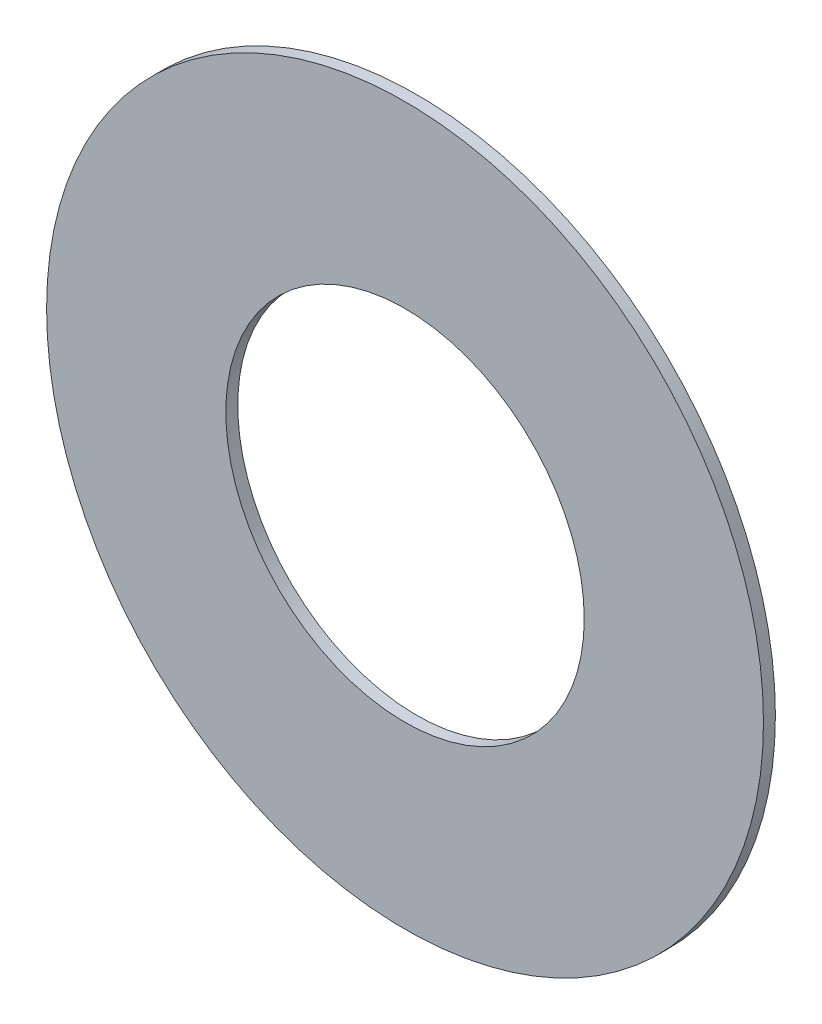
ISO-10303-21;
HEADER;
FILE_DESCRIPTION(('STEP AP214'),'2;1');
FILE_NAME('part.step','',(''),(''),'','','');
FILE_SCHEMA(('AUTOMOTIVE_DESIGN { 1 0 10303 214 1 1 1 1 }'));
ENDSEC;
DATA;
#1=APPLICATION_CONTEXT('core data for automotive mechanical design processes');
#2=APPLICATION_PROTOCOL_DEFINITION('international standard','automotive_design',2000,#1);
#3=PRODUCT_CONTEXT('',#1,'mechanical');
#4=PRODUCT('Part','Part','',(#3));
#5=PRODUCT_RELATED_PRODUCT_CATEGORY('part','',(#4));
#6=PRODUCT_DEFINITION_FORMATION('','',#4);
#7=PRODUCT_DEFINITION_CONTEXT('part definition',#1,'design');
#8=PRODUCT_DEFINITION('design','',#6,#7);
#9=PRODUCT_DEFINITION_SHAPE('','',#8);
#10=(LENGTH_UNIT() NAMED_UNIT(*) SI_UNIT(.MILLI.,.METRE.));
#11=(NAMED_UNIT(*) PLANE_ANGLE_UNIT() SI_UNIT($,.RADIAN.));
#12=(NAMED_UNIT(*) SI_UNIT($,.STERADIAN.) SOLID_ANGLE_UNIT());
#13=UNCERTAINTY_MEASURE_WITH_UNIT(LENGTH_MEASURE(1.E-05),#10,'distance_accuracy_value','');
#14=(GEOMETRIC_REPRESENTATION_CONTEXT(3) GLOBAL_UNCERTAINTY_ASSIGNED_CONTEXT((#13)) GLOBAL_UNIT_ASSIGNED_CONTEXT((#10,
#11,#12)) REPRESENTATION_CONTEXT('',''));
#15=CARTESIAN_POINT('',(0.,0.,0.));
#16=DIRECTION('',(0.,0.,1.));
#17=DIRECTION('',(1.,0.,0.));
#18=AXIS2_PLACEMENT_3D('',#15,#16,#17);
#19=CARTESIAN_POINT('',(0.,0.,0.1));
#20=DIRECTION('',(0.,0.,1.));
#21=DIRECTION('',(1.,0.,0.));
#22=AXIS2_PLACEMENT_3D('',#19,#20,#21);
#23=PLANE('',#22);
#24=CARTESIAN_POINT('',(0.,0.,0.1));
#25=DIRECTION('',(0.,0.,1.));
#26=DIRECTION('',(1.,0.,0.));
#27=AXIS2_PLACEMENT_3D('',#24,#25,#26);
#28=CIRCLE('',#27,3.);
#29=CARTESIAN_POINT('',(3.,0.,0.1));
#30=VERTEX_POINT('',#29);
#31=EDGE_CURVE('E10',#30,#30,#28,.T.);
#32=ORIENTED_EDGE('',*,*,#31,.T.);
#33=EDGE_LOOP('',(#32));
#34=FACE_BOUND('',#33,.T.);
#35=CARTESIAN_POINT('',(0.,0.,0.1));
#36=DIRECTION('',(0.,0.,1.));
#37=DIRECTION('',(1.,0.,0.));
#38=AXIS2_PLACEMENT_3D('',#35,#36,#37);
#39=CIRCLE('',#38,1.5);
#40=CARTESIAN_POINT('',(1.5,0.,0.1));
#41=VERTEX_POINT('',#40);
#42=EDGE_CURVE('E50',#41,#41,#39,.T.);
#43=ORIENTED_EDGE('',*,*,#42,.F.);
#44=EDGE_LOOP('',(#43));
#45=FACE_BOUND('',#44,.T.);
#46=ADVANCED_FACE('F37',(#34,#45),#23,.T.);
#47=CARTESIAN_POINT('',(0.,0.,0.));
#48=DIRECTION('',(0.,0.,1.));
#49=DIRECTION('',(1.,0.,0.));
#50=AXIS2_PLACEMENT_3D('',#47,#48,#49);
#51=PLANE('',#50);
#52=CARTESIAN_POINT('',(0.,0.,0.));
#53=DIRECTION('',(0.,0.,1.));
#54=DIRECTION('',(1.,0.,0.));
#55=AXIS2_PLACEMENT_3D('',#52,#53,#54);
#56=CIRCLE('',#55,3.);
#57=CARTESIAN_POINT('',(3.,0.,0.));
#58=VERTEX_POINT('',#57);
#59=EDGE_CURVE('E41',#58,#58,#56,.T.);
#60=ORIENTED_EDGE('',*,*,#59,.F.);
#61=EDGE_LOOP('',(#60));
#62=FACE_BOUND('',#61,.T.);
#63=CARTESIAN_POINT('',(0.,0.,0.));
#64=DIRECTION('',(0.,0.,1.));
#65=DIRECTION('',(1.,0.,0.));
#66=AXIS2_PLACEMENT_3D('',#63,#64,#65);
#67=CIRCLE('',#66,1.5);
#68=CARTESIAN_POINT('',(1.5,0.,0.));
#69=VERTEX_POINT('',#68);
#70=EDGE_CURVE('E52',#69,#69,#67,.T.);
#71=ORIENTED_EDGE('',*,*,#70,.T.);
#72=EDGE_LOOP('',(#71));
#73=FACE_BOUND('',#72,.T.);
#74=ADVANCED_FACE('F64',(#62,#73),#51,.F.);
#75=CARTESIAN_POINT('',(0.,0.,0.1));
#76=DIRECTION('',(0.,0.,-1.));
#77=DIRECTION('',(-1.,0.,0.));
#78=AXIS2_PLACEMENT_3D('',#75,#76,#77);
#79=CYLINDRICAL_SURFACE('',#78,3.);
#80=ORIENTED_EDGE('',*,*,#31,.F.);
#81=EDGE_LOOP('',(#80));
#82=FACE_BOUND('',#81,.T.);
#83=ORIENTED_EDGE('',*,*,#59,.T.);
#84=EDGE_LOOP('',(#83));
#85=FACE_BOUND('',#84,.T.);
#86=ADVANCED_FACE('F39',(#82,#85),#79,.T.);
#87=CARTESIAN_POINT('',(0.,0.,0.1));
#88=DIRECTION('',(0.,0.,-1.));
#89=DIRECTION('',(-1.,0.,0.));
#90=AXIS2_PLACEMENT_3D('',#87,#88,#89);
#91=CYLINDRICAL_SURFACE('',#90,1.5);
#92=ORIENTED_EDGE('',*,*,#42,.T.);
#93=EDGE_LOOP('',(#92));
#94=FACE_BOUND('',#93,.T.);
#95=ORIENTED_EDGE('',*,*,#70,.F.);
#96=EDGE_LOOP('',(#95));
#97=FACE_BOUND('',#96,.T.);
#98=ADVANCED_FACE('F60',(#94,#97),#91,.F.);
#99=CLOSED_SHELL('',(#46,#74,#86,#98));
#100=MANIFOLD_SOLID_BREP('B2',#99);
#101=ADVANCED_BREP_SHAPE_REPRESENTATION('',(#18,#100),#14);
#102=SHAPE_DEFINITION_REPRESENTATION(#9,#101);
ENDSEC;
END-ISO-10303-21;
